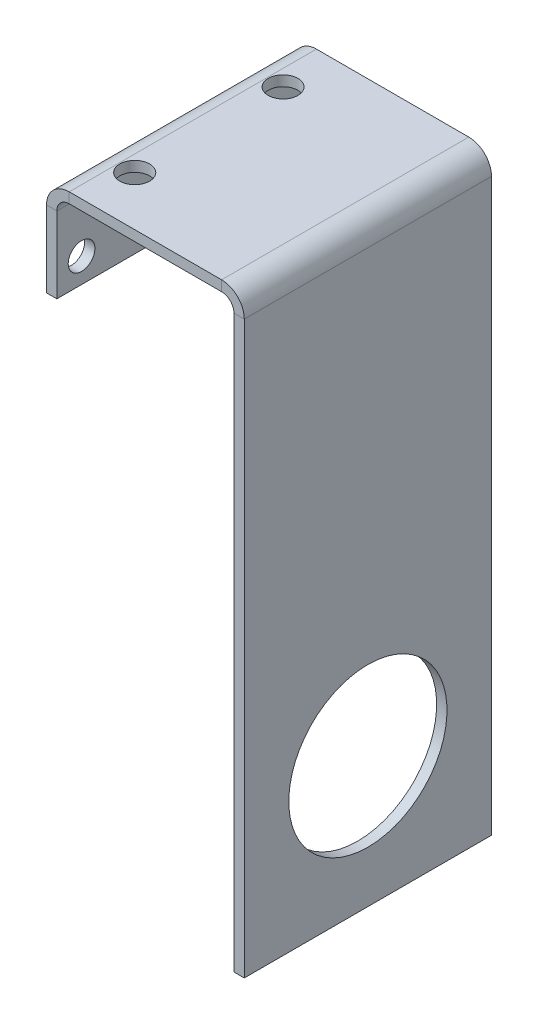
ISO-10303-21;
HEADER;
FILE_DESCRIPTION(('STEP AP214'),'2;1');
FILE_NAME('part.step','',(''),(''),'','','');
FILE_SCHEMA(('AUTOMOTIVE_DESIGN { 1 0 10303 214 1 1 1 1 }'));
ENDSEC;
DATA;
#1=APPLICATION_CONTEXT('core data for automotive mechanical design processes');
#2=APPLICATION_PROTOCOL_DEFINITION('international standard','automotive_design',2000,#1);
#3=PRODUCT_CONTEXT('',#1,'mechanical');
#4=PRODUCT('Part','Part','',(#3));
#5=PRODUCT_RELATED_PRODUCT_CATEGORY('part','',(#4));
#6=PRODUCT_DEFINITION_FORMATION('','',#4);
#7=PRODUCT_DEFINITION_CONTEXT('part definition',#1,'design');
#8=PRODUCT_DEFINITION('design','',#6,#7);
#9=PRODUCT_DEFINITION_SHAPE('','',#8);
#10=(LENGTH_UNIT() NAMED_UNIT(*) SI_UNIT(.MILLI.,.METRE.));
#11=(NAMED_UNIT(*) PLANE_ANGLE_UNIT() SI_UNIT($,.RADIAN.));
#12=(NAMED_UNIT(*) SI_UNIT($,.STERADIAN.) SOLID_ANGLE_UNIT());
#13=UNCERTAINTY_MEASURE_WITH_UNIT(LENGTH_MEASURE(1.E-05),#10,'distance_accuracy_value','');
#14=(GEOMETRIC_REPRESENTATION_CONTEXT(3) GLOBAL_UNCERTAINTY_ASSIGNED_CONTEXT((#13)) GLOBAL_UNIT_ASSIGNED_CONTEXT((#10,
#11,#12)) REPRESENTATION_CONTEXT('',''));
#15=CARTESIAN_POINT('',(0.,0.,0.));
#16=DIRECTION('',(0.,0.,1.));
#17=DIRECTION('',(1.,0.,0.));
#18=AXIS2_PLACEMENT_3D('',#15,#16,#17);
#19=CARTESIAN_POINT('',(5.83184,25.4,63.5));
#20=DIRECTION('',(0.,0.,1.));
#21=DIRECTION('',(1.,0.,0.));
#22=AXIS2_PLACEMENT_3D('',#19,#20,#21);
#23=PLANE('',#22);
#24=DIRECTION('',(0.,-1.,0.));
#25=VECTOR('',#24,1.);
#26=CARTESIAN_POINT('',(5.83184,25.4,63.5));
#27=LINE('',#26,#25);
#28=CARTESIAN_POINT('',(5.83184,25.4,63.5));
#29=VERTEX_POINT('',#28);
#30=CARTESIAN_POINT('',(5.83184,22.74316,63.5));
#31=VERTEX_POINT('',#30);
#32=EDGE_CURVE('E11',#29,#31,#27,.T.);
#33=ORIENTED_EDGE('',*,*,#32,.F.);
#34=CARTESIAN_POINT('',(5.83184,19.56816,63.5));
#35=DIRECTION('',(0.,0.,1.));
#36=DIRECTION('',(1.,0.,0.));
#37=AXIS2_PLACEMENT_3D('',#34,#35,#36);
#38=CIRCLE('',#37,5.83184);
#39=CARTESIAN_POINT('',(0.,19.56816,63.5));
#40=VERTEX_POINT('',#39);
#41=EDGE_CURVE('E283',#40,#29,#38,.F.);
#42=ORIENTED_EDGE('',*,*,#41,.F.);
#43=DIRECTION('',(-1.,0.,0.));
#44=VECTOR('',#43,1.);
#45=CARTESIAN_POINT('',(2.65684,19.56816,63.5));
#46=LINE('',#45,#44);
#47=CARTESIAN_POINT('',(2.65684,19.56816,63.5));
#48=VERTEX_POINT('',#47);
#49=EDGE_CURVE('E49',#48,#40,#46,.T.);
#50=ORIENTED_EDGE('',*,*,#49,.F.);
#51=CARTESIAN_POINT('',(5.83184,19.56816,63.5));
#52=DIRECTION('',(0.,0.,1.));
#53=DIRECTION('',(1.,0.,0.));
#54=AXIS2_PLACEMENT_3D('',#51,#52,#53);
#55=CIRCLE('',#54,3.175);
#56=EDGE_CURVE('E151',#48,#31,#55,.F.);
#57=ORIENTED_EDGE('',*,*,#56,.T.);
#58=EDGE_LOOP('',(#33,#42,#50,#57));
#59=FACE_BOUND('',#58,.T.);
#60=ADVANCED_FACE('F40',(#59),#23,.T.);
#61=CARTESIAN_POINT('',(2.65684,19.56816,63.5));
#62=DIRECTION('',(0.,0.,1.));
#63=DIRECTION('',(1.,0.,0.));
#64=AXIS2_PLACEMENT_3D('',#61,#62,#63);
#65=PLANE('',#64);
#66=DIRECTION('',(1.,0.,0.));
#67=VECTOR('',#66,1.);
#68=CARTESIAN_POINT('',(0.,25.4,63.5));
#69=LINE('',#68,#67);
#70=CARTESIAN_POINT('',(44.96816,25.4,63.5));
#71=VERTEX_POINT('',#70);
#72=EDGE_CURVE('E145',#29,#71,#69,.T.);
#73=ORIENTED_EDGE('',*,*,#72,.F.);
#74=ORIENTED_EDGE('',*,*,#32,.T.);
#75=DIRECTION('',(1.,0.,0.));
#76=VECTOR('',#75,1.);
#77=CARTESIAN_POINT('',(0.,22.74316,63.5));
#78=LINE('',#77,#76);
#79=CARTESIAN_POINT('',(44.96816,22.74316,63.5));
#80=VERTEX_POINT('',#79);
#81=EDGE_CURVE('E142',#31,#80,#78,.T.);
#82=ORIENTED_EDGE('',*,*,#81,.T.);
#83=DIRECTION('',(0.,1.,0.));
#84=VECTOR('',#83,1.);
#85=CARTESIAN_POINT('',(44.96816,22.74316,63.5));
#86=LINE('',#85,#84);
#87=EDGE_CURVE('E234',#80,#71,#86,.T.);
#88=ORIENTED_EDGE('',*,*,#87,.T.);
#89=EDGE_LOOP('',(#73,#74,#82,#88));
#90=FACE_BOUND('',#89,.T.);
#91=ADVANCED_FACE('F140',(#90),#65,.T.);
#92=CARTESIAN_POINT('',(0.,19.56816,0.));
#93=DIRECTION('',(0.,0.,-1.));
#94=DIRECTION('',(-1.,0.,0.));
#95=AXIS2_PLACEMENT_3D('',#92,#93,#94);
#96=PLANE('',#95);
#97=DIRECTION('',(1.,0.,0.));
#98=VECTOR('',#97,1.);
#99=CARTESIAN_POINT('',(0.,19.56816,0.));
#100=LINE('',#99,#98);
#101=CARTESIAN_POINT('',(0.,19.56816,0.));
#102=VERTEX_POINT('',#101);
#103=CARTESIAN_POINT('',(2.65684,19.56816,0.));
#104=VERTEX_POINT('',#103);
#105=EDGE_CURVE('E239',#102,#104,#100,.T.);
#106=ORIENTED_EDGE('',*,*,#105,.F.);
#107=CARTESIAN_POINT('',(5.83184,19.56816,0.));
#108=DIRECTION('',(0.,0.,1.));
#109=DIRECTION('',(1.,0.,0.));
#110=AXIS2_PLACEMENT_3D('',#107,#108,#109);
#111=CIRCLE('',#110,5.83184);
#112=CARTESIAN_POINT('',(5.83184,25.4,0.));
#113=VERTEX_POINT('',#112);
#114=EDGE_CURVE('E191',#102,#113,#111,.F.);
#115=ORIENTED_EDGE('',*,*,#114,.T.);
#116=DIRECTION('',(0.,1.,0.));
#117=VECTOR('',#116,1.);
#118=CARTESIAN_POINT('',(5.83184,22.74316,0.));
#119=LINE('',#118,#117);
#120=CARTESIAN_POINT('',(5.83184,22.74316,0.));
#121=VERTEX_POINT('',#120);
#122=EDGE_CURVE('E237',#121,#113,#119,.T.);
#123=ORIENTED_EDGE('',*,*,#122,.F.);
#124=CARTESIAN_POINT('',(5.83184,19.56816,0.));
#125=DIRECTION('',(0.,0.,1.));
#126=DIRECTION('',(1.,0.,0.));
#127=AXIS2_PLACEMENT_3D('',#124,#125,#126);
#128=CIRCLE('',#127,3.175);
#129=EDGE_CURVE('E163',#104,#121,#128,.F.);
#130=ORIENTED_EDGE('',*,*,#129,.F.);
#131=EDGE_LOOP('',(#106,#115,#123,#130));
#132=FACE_BOUND('',#131,.T.);
#133=ADVANCED_FACE('F301',(#132),#96,.T.);
#134=CARTESIAN_POINT('',(5.83184,22.74316,0.));
#135=DIRECTION('',(0.,0.,-1.));
#136=DIRECTION('',(-1.,0.,0.));
#137=AXIS2_PLACEMENT_3D('',#134,#135,#136);
#138=PLANE('',#137);
#139=DIRECTION('',(0.,1.,0.));
#140=VECTOR('',#139,1.);
#141=CARTESIAN_POINT('',(0.,0.,0.));
#142=LINE('',#141,#140);
#143=CARTESIAN_POINT('',(0.,0.,0.));
#144=VERTEX_POINT('',#143);
#145=EDGE_CURVE('E194',#144,#102,#142,.T.);
#146=ORIENTED_EDGE('',*,*,#145,.T.);
#147=ORIENTED_EDGE('',*,*,#105,.T.);
#148=DIRECTION('',(0.,1.,0.));
#149=VECTOR('',#148,1.);
#150=CARTESIAN_POINT('',(2.65684,0.,0.));
#151=LINE('',#150,#149);
#152=CARTESIAN_POINT('',(2.65684,0.,0.));
#153=VERTEX_POINT('',#152);
#154=EDGE_CURVE('E200',#153,#104,#151,.T.);
#155=ORIENTED_EDGE('',*,*,#154,.F.);
#156=DIRECTION('',(-1.,0.,0.));
#157=VECTOR('',#156,1.);
#158=CARTESIAN_POINT('',(2.65684,0.,0.));
#159=LINE('',#158,#157);
#160=EDGE_CURVE('E197',#153,#144,#159,.T.);
#161=ORIENTED_EDGE('',*,*,#160,.T.);
#162=EDGE_LOOP('',(#146,#147,#155,#161));
#163=FACE_BOUND('',#162,.T.);
#164=ADVANCED_FACE('F348',(#163),#138,.T.);
#165=CARTESIAN_POINT('',(50.8,19.56816,63.5));
#166=DIRECTION('',(0.,0.,1.));
#167=DIRECTION('',(1.,0.,0.));
#168=AXIS2_PLACEMENT_3D('',#165,#166,#167);
#169=PLANE('',#168);
#170=DIRECTION('',(-1.,0.,0.));
#171=VECTOR('',#170,1.);
#172=CARTESIAN_POINT('',(50.8,19.56816,63.5));
#173=LINE('',#172,#171);
#174=CARTESIAN_POINT('',(50.8,19.56816,63.5));
#175=VERTEX_POINT('',#174);
#176=CARTESIAN_POINT('',(48.14316,19.56816,63.5));
#177=VERTEX_POINT('',#176);
#178=EDGE_CURVE('E58',#175,#177,#173,.T.);
#179=ORIENTED_EDGE('',*,*,#178,.F.);
#180=CARTESIAN_POINT('',(44.96816,19.56816,63.5));
#181=DIRECTION('',(0.,0.,1.));
#182=DIRECTION('',(1.,0.,0.));
#183=AXIS2_PLACEMENT_3D('',#180,#181,#182);
#184=CIRCLE('',#183,5.83184);
#185=EDGE_CURVE('E279',#71,#175,#184,.F.);
#186=ORIENTED_EDGE('',*,*,#185,.F.);
#187=ORIENTED_EDGE('',*,*,#87,.F.);
#188=CARTESIAN_POINT('',(44.96816,19.56816,63.5));
#189=DIRECTION('',(0.,0.,1.));
#190=DIRECTION('',(1.,0.,0.));
#191=AXIS2_PLACEMENT_3D('',#188,#189,#190);
#192=CIRCLE('',#191,3.175);
#193=EDGE_CURVE('E171',#80,#177,#192,.F.);
#194=ORIENTED_EDGE('',*,*,#193,.T.);
#195=EDGE_LOOP('',(#179,#186,#187,#194));
#196=FACE_BOUND('',#195,.T.);
#197=ADVANCED_FACE('F353',(#196),#169,.T.);
#198=CARTESIAN_POINT('',(44.96816,22.74316,63.5));
#199=DIRECTION('',(0.,0.,1.));
#200=DIRECTION('',(1.,0.,0.));
#201=AXIS2_PLACEMENT_3D('',#198,#199,#200);
#202=PLANE('',#201);
#203=DIRECTION('',(0.,-1.,0.));
#204=VECTOR('',#203,1.);
#205=CARTESIAN_POINT('',(50.8,25.4,63.5));
#206=LINE('',#205,#204);
#207=CARTESIAN_POINT('',(50.8,-127.,63.5));
#208=VERTEX_POINT('',#207);
#209=EDGE_CURVE('E276',#175,#208,#206,.T.);
#210=ORIENTED_EDGE('',*,*,#209,.F.);
#211=ORIENTED_EDGE('',*,*,#178,.T.);
#212=DIRECTION('',(0.,-1.,0.));
#213=VECTOR('',#212,1.);
#214=CARTESIAN_POINT('',(48.14316,25.4,63.5));
#215=LINE('',#214,#213);
#216=CARTESIAN_POINT('',(48.14316,-127.,63.5));
#217=VERTEX_POINT('',#216);
#218=EDGE_CURVE('E112',#177,#217,#215,.T.);
#219=ORIENTED_EDGE('',*,*,#218,.T.);
#220=DIRECTION('',(-1.,0.,0.));
#221=VECTOR('',#220,1.);
#222=CARTESIAN_POINT('',(50.8,-127.,63.5));
#223=LINE('',#222,#221);
#224=EDGE_CURVE('E273',#208,#217,#223,.T.);
#225=ORIENTED_EDGE('',*,*,#224,.F.);
#226=EDGE_LOOP('',(#210,#211,#219,#225));
#227=FACE_BOUND('',#226,.T.);
#228=ADVANCED_FACE('F328',(#227),#202,.T.);
#229=CARTESIAN_POINT('',(44.96816,25.4,0.));
#230=DIRECTION('',(0.,0.,-1.));
#231=DIRECTION('',(-1.,0.,0.));
#232=AXIS2_PLACEMENT_3D('',#229,#230,#231);
#233=PLANE('',#232);
#234=DIRECTION('',(0.,-1.,0.));
#235=VECTOR('',#234,1.);
#236=CARTESIAN_POINT('',(44.96816,25.4,0.));
#237=LINE('',#236,#235);
#238=CARTESIAN_POINT('',(44.96816,25.4,0.));
#239=VERTEX_POINT('',#238);
#240=CARTESIAN_POINT('',(44.96816,22.74316,0.));
#241=VERTEX_POINT('',#240);
#242=EDGE_CURVE('E99',#239,#241,#237,.T.);
#243=ORIENTED_EDGE('',*,*,#242,.F.);
#244=CARTESIAN_POINT('',(44.96816,19.56816,0.));
#245=DIRECTION('',(0.,0.,1.));
#246=DIRECTION('',(1.,0.,0.));
#247=AXIS2_PLACEMENT_3D('',#244,#245,#246);
#248=CIRCLE('',#247,5.83184);
#249=CARTESIAN_POINT('',(50.8,19.56816,0.));
#250=VERTEX_POINT('',#249);
#251=EDGE_CURVE('E187',#239,#250,#248,.F.);
#252=ORIENTED_EDGE('',*,*,#251,.T.);
#253=DIRECTION('',(1.,0.,0.));
#254=VECTOR('',#253,1.);
#255=CARTESIAN_POINT('',(48.14316,19.56816,0.));
#256=LINE('',#255,#254);
#257=CARTESIAN_POINT('',(48.14316,19.56816,0.));
#258=VERTEX_POINT('',#257);
#259=EDGE_CURVE('E106',#258,#250,#256,.T.);
#260=ORIENTED_EDGE('',*,*,#259,.F.);
#261=CARTESIAN_POINT('',(44.96816,19.56816,0.));
#262=DIRECTION('',(0.,0.,1.));
#263=DIRECTION('',(1.,0.,0.));
#264=AXIS2_PLACEMENT_3D('',#261,#262,#263);
#265=CIRCLE('',#264,3.175);
#266=EDGE_CURVE('E206',#241,#258,#265,.F.);
#267=ORIENTED_EDGE('',*,*,#266,.F.);
#268=EDGE_LOOP('',(#243,#252,#260,#267));
#269=FACE_BOUND('',#268,.T.);
#270=ADVANCED_FACE('F316',(#269),#233,.T.);
#271=CARTESIAN_POINT('',(48.14316,19.56816,0.));
#272=DIRECTION('',(0.,0.,-1.));
#273=DIRECTION('',(-1.,0.,0.));
#274=AXIS2_PLACEMENT_3D('',#271,#272,#273);
#275=PLANE('',#274);
#276=DIRECTION('',(1.,0.,0.));
#277=VECTOR('',#276,1.);
#278=CARTESIAN_POINT('',(0.,25.4,0.));
#279=LINE('',#278,#277);
#280=EDGE_CURVE('E189',#113,#239,#279,.T.);
#281=ORIENTED_EDGE('',*,*,#280,.T.);
#282=ORIENTED_EDGE('',*,*,#242,.T.);
#283=DIRECTION('',(1.,0.,0.));
#284=VECTOR('',#283,1.);
#285=CARTESIAN_POINT('',(0.,22.74316,0.));
#286=LINE('',#285,#284);
#287=EDGE_CURVE('E204',#121,#241,#286,.T.);
#288=ORIENTED_EDGE('',*,*,#287,.F.);
#289=ORIENTED_EDGE('',*,*,#122,.T.);
#290=EDGE_LOOP('',(#281,#282,#288,#289));
#291=FACE_BOUND('',#290,.T.);
#292=ADVANCED_FACE('F303',(#291),#275,.T.);
#293=CARTESIAN_POINT('',(48.14316,25.4,63.5));
#294=DIRECTION('',(1.,0.,0.));
#295=DIRECTION('',(0.,1.,0.));
#296=AXIS2_PLACEMENT_3D('',#293,#294,#295);
#297=PLANE('',#296);
#298=CARTESIAN_POINT('',(48.14316,-93.46184,31.75));
#299=DIRECTION('',(1.,0.,0.));
#300=DIRECTION('',(0.,1.,0.));
#301=AXIS2_PLACEMENT_3D('',#298,#299,#300);
#302=CIRCLE('',#301,20.32);
#303=CARTESIAN_POINT('',(48.14316,-73.14184,31.75));
#304=VERTEX_POINT('',#303);
#305=EDGE_CURVE('E264',#304,#304,#302,.T.);
#306=ORIENTED_EDGE('',*,*,#305,.T.);
#307=EDGE_LOOP('',(#306));
#308=FACE_BOUND('',#307,.T.);
#309=DIRECTION('',(0.,-1.,0.));
#310=VECTOR('',#309,1.);
#311=CARTESIAN_POINT('',(48.14316,25.4,0.));
#312=LINE('',#311,#310);
#313=CARTESIAN_POINT('',(48.14316,-127.,0.));
#314=VERTEX_POINT('',#313);
#315=EDGE_CURVE('E177',#258,#314,#312,.T.);
#316=ORIENTED_EDGE('',*,*,#315,.T.);
#317=DIRECTION('',(0.,0.,-1.));
#318=VECTOR('',#317,1.);
#319=CARTESIAN_POINT('',(48.14316,-127.,63.5));
#320=LINE('',#319,#318);
#321=EDGE_CURVE('E230',#217,#314,#320,.T.);
#322=ORIENTED_EDGE('',*,*,#321,.F.);
#323=ORIENTED_EDGE('',*,*,#218,.F.);
#324=DIRECTION('',(0.,0.,-1.));
#325=VECTOR('',#324,1.);
#326=CARTESIAN_POINT('',(48.14316,19.56816,63.5));
#327=LINE('',#326,#325);
#328=EDGE_CURVE('E173',#177,#258,#327,.T.);
#329=ORIENTED_EDGE('',*,*,#328,.T.);
#330=EDGE_LOOP('',(#316,#322,#323,#329));
#331=FACE_BOUND('',#330,.T.);
#332=ADVANCED_FACE('F322',(#308,#331),#297,.F.);
#333=CARTESIAN_POINT('',(50.8,-127.,63.5));
#334=DIRECTION('',(0.,-1.,0.));
#335=DIRECTION('',(0.,0.,-1.));
#336=AXIS2_PLACEMENT_3D('',#333,#334,#335);
#337=PLANE('',#336);
#338=DIRECTION('',(-1.,0.,0.));
#339=VECTOR('',#338,1.);
#340=CARTESIAN_POINT('',(50.8,-127.,0.));
#341=LINE('',#340,#339);
#342=CARTESIAN_POINT('',(50.8,-127.,0.));
#343=VERTEX_POINT('',#342);
#344=EDGE_CURVE('E180',#343,#314,#341,.T.);
#345=ORIENTED_EDGE('',*,*,#344,.F.);
#346=DIRECTION('',(0.,0.,-1.));
#347=VECTOR('',#346,1.);
#348=CARTESIAN_POINT('',(50.8,-127.,63.5));
#349=LINE('',#348,#347);
#350=EDGE_CURVE('E228',#208,#343,#349,.T.);
#351=ORIENTED_EDGE('',*,*,#350,.F.);
#352=ORIENTED_EDGE('',*,*,#224,.T.);
#353=ORIENTED_EDGE('',*,*,#321,.T.);
#354=EDGE_LOOP('',(#345,#351,#352,#353));
#355=FACE_BOUND('',#354,.T.);
#356=ADVANCED_FACE('F327',(#355),#337,.T.);
#357=CARTESIAN_POINT('',(50.8,25.4,63.5));
#358=DIRECTION('',(1.,0.,0.));
#359=DIRECTION('',(0.,1.,0.));
#360=AXIS2_PLACEMENT_3D('',#357,#358,#359);
#361=PLANE('',#360);
#362=CARTESIAN_POINT('',(50.8,-93.46184,31.75));
#363=DIRECTION('',(1.,0.,0.));
#364=DIRECTION('',(0.,1.,0.));
#365=AXIS2_PLACEMENT_3D('',#362,#363,#364);
#366=CIRCLE('',#365,20.32);
#367=CARTESIAN_POINT('',(50.8,-73.14184,31.75));
#368=VERTEX_POINT('',#367);
#369=EDGE_CURVE('E253',#368,#368,#366,.T.);
#370=ORIENTED_EDGE('',*,*,#369,.F.);
#371=EDGE_LOOP('',(#370));
#372=FACE_BOUND('',#371,.T.);
#373=DIRECTION('',(0.,-1.,0.));
#374=VECTOR('',#373,1.);
#375=CARTESIAN_POINT('',(50.8,25.4,0.));
#376=LINE('',#375,#374);
#377=EDGE_CURVE('E184',#250,#343,#376,.T.);
#378=ORIENTED_EDGE('',*,*,#377,.F.);
#379=DIRECTION('',(0.,0.,-1.));
#380=VECTOR('',#379,1.);
#381=CARTESIAN_POINT('',(50.8,19.56816,63.5));
#382=LINE('',#381,#380);
#383=EDGE_CURVE('E225',#175,#250,#382,.T.);
#384=ORIENTED_EDGE('',*,*,#383,.F.);
#385=ORIENTED_EDGE('',*,*,#209,.T.);
#386=ORIENTED_EDGE('',*,*,#350,.T.);
#387=EDGE_LOOP('',(#378,#384,#385,#386));
#388=FACE_BOUND('',#387,.T.);
#389=ADVANCED_FACE('F330',(#372,#388),#361,.T.);
#390=CARTESIAN_POINT('',(44.96816,19.56816,63.5));
#391=DIRECTION('',(0.,0.,-1.));
#392=DIRECTION('',(-1.,0.,0.));
#393=AXIS2_PLACEMENT_3D('',#390,#391,#392);
#394=CYLINDRICAL_SURFACE('',#393,5.83184);
#395=ORIENTED_EDGE('',*,*,#251,.F.);
#396=DIRECTION('',(0.,0.,-1.));
#397=VECTOR('',#396,1.);
#398=CARTESIAN_POINT('',(44.96816,25.4,63.5));
#399=LINE('',#398,#397);
#400=EDGE_CURVE('E222',#71,#239,#399,.T.);
#401=ORIENTED_EDGE('',*,*,#400,.F.);
#402=ORIENTED_EDGE('',*,*,#185,.T.);
#403=ORIENTED_EDGE('',*,*,#383,.T.);
#404=EDGE_LOOP('',(#395,#401,#402,#403));
#405=FACE_BOUND('',#404,.T.);
#406=ADVANCED_FACE('F313',(#405),#394,.T.);
#407=CARTESIAN_POINT('',(0.,25.4,63.5));
#408=DIRECTION('',(0.,1.,0.));
#409=DIRECTION('',(0.,0.,1.));
#410=AXIS2_PLACEMENT_3D('',#407,#408,#409);
#411=PLANE('',#410);
#412=CARTESIAN_POINT('',(9.95680000035909,25.4,12.6999999983096));
#413=DIRECTION('',(0.,1.,0.));
#414=DIRECTION('',(0.,0.,1.));
#415=AXIS2_PLACEMENT_3D('',#412,#413,#414);
#416=CIRCLE('',#415,3.809999999705);
#417=CARTESIAN_POINT('',(9.95680000035909,25.4,16.5099999980146));
#418=VERTEX_POINT('',#417);
#419=EDGE_CURVE('E249',#418,#418,#416,.T.);
#420=ORIENTED_EDGE('',*,*,#419,.F.);
#421=EDGE_LOOP('',(#420));
#422=FACE_BOUND('',#421,.T.);
#423=CARTESIAN_POINT('',(9.95680000035942,25.4,50.7999999983095));
#424=DIRECTION('',(0.,1.,0.));
#425=DIRECTION('',(0.,0.,1.));
#426=AXIS2_PLACEMENT_3D('',#423,#424,#425);
#427=CIRCLE('',#426,3.83152444364482);
#428=CARTESIAN_POINT('',(9.95680000035942,25.4,54.6315244419543));
#429=VERTEX_POINT('',#428);
#430=EDGE_CURVE('E255',#429,#429,#427,.T.);
#431=ORIENTED_EDGE('',*,*,#430,.F.);
#432=EDGE_LOOP('',(#431));
#433=FACE_BOUND('',#432,.T.);
#434=ORIENTED_EDGE('',*,*,#280,.F.);
#435=DIRECTION('',(0.,0.,-1.));
#436=VECTOR('',#435,1.);
#437=CARTESIAN_POINT('',(5.83184,25.4,63.5));
#438=LINE('',#437,#436);
#439=EDGE_CURVE('E219',#29,#113,#438,.T.);
#440=ORIENTED_EDGE('',*,*,#439,.F.);
#441=ORIENTED_EDGE('',*,*,#72,.T.);
#442=ORIENTED_EDGE('',*,*,#400,.T.);
#443=EDGE_LOOP('',(#434,#440,#441,#442));
#444=FACE_BOUND('',#443,.T.);
#445=ADVANCED_FACE('F308',(#422,#433,#444),#411,.T.);
#446=CARTESIAN_POINT('',(5.83184,19.56816,63.5));
#447=DIRECTION('',(0.,0.,-1.));
#448=DIRECTION('',(-1.,0.,0.));
#449=AXIS2_PLACEMENT_3D('',#446,#447,#448);
#450=CYLINDRICAL_SURFACE('',#449,5.83184);
#451=ORIENTED_EDGE('',*,*,#114,.F.);
#452=DIRECTION('',(0.,0.,-1.));
#453=VECTOR('',#452,1.);
#454=CARTESIAN_POINT('',(0.,19.56816,63.5));
#455=LINE('',#454,#453);
#456=EDGE_CURVE('E216',#40,#102,#455,.T.);
#457=ORIENTED_EDGE('',*,*,#456,.F.);
#458=ORIENTED_EDGE('',*,*,#41,.T.);
#459=ORIENTED_EDGE('',*,*,#439,.T.);
#460=EDGE_LOOP('',(#451,#457,#458,#459));
#461=FACE_BOUND('',#460,.T.);
#462=ADVANCED_FACE('F306',(#461),#450,.T.);
#463=CARTESIAN_POINT('',(0.,0.,63.5));
#464=DIRECTION('',(-1.,0.,0.));
#465=DIRECTION('',(0.,0.,1.));
#466=AXIS2_PLACEMENT_3D('',#463,#464,#465);
#467=PLANE('',#466);
#468=CARTESIAN_POINT('',(0.,6.35,6.35));
#469=DIRECTION('',(-1.,0.,0.));
#470=DIRECTION('',(0.,0.,1.));
#471=AXIS2_PLACEMENT_3D('',#468,#469,#470);
#472=CIRCLE('',#471,3.429);
#473=CARTESIAN_POINT('',(0.,6.35,9.779));
#474=VERTEX_POINT('',#473);
#475=EDGE_CURVE('E245',#474,#474,#472,.T.);
#476=ORIENTED_EDGE('',*,*,#475,.F.);
#477=EDGE_LOOP('',(#476));
#478=FACE_BOUND('',#477,.T.);
#479=CARTESIAN_POINT('',(0.,6.35,57.15));
#480=DIRECTION('',(-1.,0.,0.));
#481=DIRECTION('',(0.,0.,1.));
#482=AXIS2_PLACEMENT_3D('',#479,#480,#481);
#483=CIRCLE('',#482,3.429);
#484=CARTESIAN_POINT('',(0.,6.35,60.579));
#485=VERTEX_POINT('',#484);
#486=EDGE_CURVE('E267',#485,#485,#483,.T.);
#487=ORIENTED_EDGE('',*,*,#486,.F.);
#488=EDGE_LOOP('',(#487));
#489=FACE_BOUND('',#488,.T.);
#490=ORIENTED_EDGE('',*,*,#145,.F.);
#491=DIRECTION('',(0.,0.,-1.));
#492=VECTOR('',#491,1.);
#493=CARTESIAN_POINT('',(0.,0.,63.5));
#494=LINE('',#493,#492);
#495=CARTESIAN_POINT('',(0.,0.,63.5));
#496=VERTEX_POINT('',#495);
#497=EDGE_CURVE('E214',#496,#144,#494,.T.);
#498=ORIENTED_EDGE('',*,*,#497,.F.);
#499=DIRECTION('',(0.,1.,0.));
#500=VECTOR('',#499,1.);
#501=CARTESIAN_POINT('',(0.,0.,63.5));
#502=LINE('',#501,#500);
#503=EDGE_CURVE('E285',#496,#40,#502,.T.);
#504=ORIENTED_EDGE('',*,*,#503,.T.);
#505=ORIENTED_EDGE('',*,*,#456,.T.);
#506=EDGE_LOOP('',(#490,#498,#504,#505));
#507=FACE_BOUND('',#506,.T.);
#508=ADVANCED_FACE('F408',(#478,#489,#507),#467,.T.);
#509=CARTESIAN_POINT('',(2.65684,0.,63.5));
#510=DIRECTION('',(0.,-1.,0.));
#511=DIRECTION('',(0.,0.,-1.));
#512=AXIS2_PLACEMENT_3D('',#509,#510,#511);
#513=PLANE('',#512);
#514=ORIENTED_EDGE('',*,*,#160,.F.);
#515=DIRECTION('',(0.,0.,-1.));
#516=VECTOR('',#515,1.);
#517=CARTESIAN_POINT('',(2.65684,0.,63.5));
#518=LINE('',#517,#516);
#519=CARTESIAN_POINT('',(2.65684,0.,63.5));
#520=VERTEX_POINT('',#519);
#521=EDGE_CURVE('E212',#520,#153,#518,.T.);
#522=ORIENTED_EDGE('',*,*,#521,.F.);
#523=DIRECTION('',(-1.,0.,0.));
#524=VECTOR('',#523,1.);
#525=CARTESIAN_POINT('',(2.65684,0.,63.5));
#526=LINE('',#525,#524);
#527=EDGE_CURVE('E288',#520,#496,#526,.T.);
#528=ORIENTED_EDGE('',*,*,#527,.T.);
#529=ORIENTED_EDGE('',*,*,#497,.T.);
#530=EDGE_LOOP('',(#514,#522,#528,#529));
#531=FACE_BOUND('',#530,.T.);
#532=ADVANCED_FACE('F404',(#531),#513,.T.);
#533=CARTESIAN_POINT('',(2.65684,0.,63.5));
#534=DIRECTION('',(-1.,0.,0.));
#535=DIRECTION('',(0.,0.,1.));
#536=AXIS2_PLACEMENT_3D('',#533,#534,#535);
#537=PLANE('',#536);
#538=CARTESIAN_POINT('',(2.65684,6.35,6.35));
#539=DIRECTION('',(-1.,0.,0.));
#540=DIRECTION('',(0.,0.,1.));
#541=AXIS2_PLACEMENT_3D('',#538,#539,#540);
#542=CIRCLE('',#541,3.429);
#543=CARTESIAN_POINT('',(2.65684,6.35,9.779));
#544=VERTEX_POINT('',#543);
#545=EDGE_CURVE('E181',#544,#544,#542,.T.);
#546=ORIENTED_EDGE('',*,*,#545,.T.);
#547=EDGE_LOOP('',(#546));
#548=FACE_BOUND('',#547,.T.);
#549=CARTESIAN_POINT('',(2.65684,6.35,57.15));
#550=DIRECTION('',(-1.,0.,0.));
#551=DIRECTION('',(0.,0.,1.));
#552=AXIS2_PLACEMENT_3D('',#549,#550,#551);
#553=CIRCLE('',#552,3.429);
#554=CARTESIAN_POINT('',(2.65684,6.35,60.579));
#555=VERTEX_POINT('',#554);
#556=EDGE_CURVE('E242',#555,#555,#553,.T.);
#557=ORIENTED_EDGE('',*,*,#556,.T.);
#558=EDGE_LOOP('',(#557));
#559=FACE_BOUND('',#558,.T.);
#560=ORIENTED_EDGE('',*,*,#154,.T.);
#561=DIRECTION('',(0.,0.,-1.));
#562=VECTOR('',#561,1.);
#563=CARTESIAN_POINT('',(2.65684,19.56816,63.5));
#564=LINE('',#563,#562);
#565=EDGE_CURVE('E165',#48,#104,#564,.T.);
#566=ORIENTED_EDGE('',*,*,#565,.F.);
#567=DIRECTION('',(0.,1.,0.));
#568=VECTOR('',#567,1.);
#569=CARTESIAN_POINT('',(2.65684,0.,63.5));
#570=LINE('',#569,#568);
#571=EDGE_CURVE('E156',#520,#48,#570,.T.);
#572=ORIENTED_EDGE('',*,*,#571,.F.);
#573=ORIENTED_EDGE('',*,*,#521,.T.);
#574=EDGE_LOOP('',(#560,#566,#572,#573));
#575=FACE_BOUND('',#574,.T.);
#576=ADVANCED_FACE('F298',(#548,#559,#575),#537,.F.);
#577=CARTESIAN_POINT('',(5.83184,19.56816,63.5));
#578=DIRECTION('',(0.,0.,-1.));
#579=DIRECTION('',(-1.,0.,0.));
#580=AXIS2_PLACEMENT_3D('',#577,#578,#579);
#581=CYLINDRICAL_SURFACE('',#580,3.175);
#582=ORIENTED_EDGE('',*,*,#129,.T.);
#583=DIRECTION('',(0.,0.,-1.));
#584=VECTOR('',#583,1.);
#585=CARTESIAN_POINT('',(5.83184,22.74316,63.5));
#586=LINE('',#585,#584);
#587=EDGE_CURVE('E160',#31,#121,#586,.T.);
#588=ORIENTED_EDGE('',*,*,#587,.F.);
#589=ORIENTED_EDGE('',*,*,#56,.F.);
#590=ORIENTED_EDGE('',*,*,#565,.T.);
#591=EDGE_LOOP('',(#582,#588,#589,#590));
#592=FACE_BOUND('',#591,.T.);
#593=ADVANCED_FACE('F161',(#592),#581,.F.);
#594=CARTESIAN_POINT('',(0.,22.74316,63.5));
#595=DIRECTION('',(0.,1.,0.));
#596=DIRECTION('',(0.,0.,1.));
#597=AXIS2_PLACEMENT_3D('',#594,#595,#596);
#598=PLANE('',#597);
#599=CARTESIAN_POINT('',(9.95680000035909,22.74316,12.6999999983096));
#600=DIRECTION('',(0.,1.,0.));
#601=DIRECTION('',(0.,0.,1.));
#602=AXIS2_PLACEMENT_3D('',#599,#600,#601);
#603=CIRCLE('',#602,3.809999999705);
#604=CARTESIAN_POINT('',(9.95680000035909,22.74316,16.5099999980146));
#605=VERTEX_POINT('',#604);
#606=EDGE_CURVE('E43',#605,#605,#603,.T.);
#607=ORIENTED_EDGE('',*,*,#606,.T.);
#608=EDGE_LOOP('',(#607));
#609=FACE_BOUND('',#608,.T.);
#610=CARTESIAN_POINT('',(9.95680000035942,22.74316,50.7999999983095));
#611=DIRECTION('',(0.,1.,0.));
#612=DIRECTION('',(0.,0.,1.));
#613=AXIS2_PLACEMENT_3D('',#610,#611,#612);
#614=CIRCLE('',#613,3.83152444364482);
#615=CARTESIAN_POINT('',(9.95680000035942,22.74316,54.6315244419543));
#616=VERTEX_POINT('',#615);
#617=EDGE_CURVE('E247',#616,#616,#614,.T.);
#618=ORIENTED_EDGE('',*,*,#617,.T.);
#619=EDGE_LOOP('',(#618));
#620=FACE_BOUND('',#619,.T.);
#621=ORIENTED_EDGE('',*,*,#287,.T.);
#622=DIRECTION('',(0.,0.,-1.));
#623=VECTOR('',#622,1.);
#624=CARTESIAN_POINT('',(44.96816,22.74316,63.5));
#625=LINE('',#624,#623);
#626=EDGE_CURVE('E166',#80,#241,#625,.T.);
#627=ORIENTED_EDGE('',*,*,#626,.F.);
#628=ORIENTED_EDGE('',*,*,#81,.F.);
#629=ORIENTED_EDGE('',*,*,#587,.T.);
#630=EDGE_LOOP('',(#621,#627,#628,#629));
#631=FACE_BOUND('',#630,.T.);
#632=ADVANCED_FACE('F168',(#609,#620,#631),#598,.F.);
#633=CARTESIAN_POINT('',(44.96816,19.56816,63.5));
#634=DIRECTION('',(0.,0.,-1.));
#635=DIRECTION('',(-1.,0.,0.));
#636=AXIS2_PLACEMENT_3D('',#633,#634,#635);
#637=CYLINDRICAL_SURFACE('',#636,3.175);
#638=ORIENTED_EDGE('',*,*,#266,.T.);
#639=ORIENTED_EDGE('',*,*,#328,.F.);
#640=ORIENTED_EDGE('',*,*,#193,.F.);
#641=ORIENTED_EDGE('',*,*,#626,.T.);
#642=EDGE_LOOP('',(#638,#639,#640,#641));
#643=FACE_BOUND('',#642,.T.);
#644=ADVANCED_FACE('F319',(#643),#637,.F.);
#645=CARTESIAN_POINT('',(44.96816,19.56816,63.5));
#646=DIRECTION('',(0.,0.,1.));
#647=DIRECTION('',(1.,0.,0.));
#648=AXIS2_PLACEMENT_3D('',#645,#646,#647);
#649=PLANE('',#648);
#650=ORIENTED_EDGE('',*,*,#571,.T.);
#651=ORIENTED_EDGE('',*,*,#49,.T.);
#652=ORIENTED_EDGE('',*,*,#503,.F.);
#653=ORIENTED_EDGE('',*,*,#527,.F.);
#654=EDGE_LOOP('',(#650,#651,#652,#653));
#655=FACE_BOUND('',#654,.T.);
#656=ADVANCED_FACE('F294',(#655),#649,.T.);
#657=CARTESIAN_POINT('',(44.96816,19.56816,0.));
#658=DIRECTION('',(0.,0.,1.));
#659=DIRECTION('',(1.,0.,0.));
#660=AXIS2_PLACEMENT_3D('',#657,#658,#659);
#661=PLANE('',#660);
#662=ORIENTED_EDGE('',*,*,#315,.F.);
#663=ORIENTED_EDGE('',*,*,#259,.T.);
#664=ORIENTED_EDGE('',*,*,#377,.T.);
#665=ORIENTED_EDGE('',*,*,#344,.T.);
#666=EDGE_LOOP('',(#662,#663,#664,#665));
#667=FACE_BOUND('',#666,.T.);
#668=ADVANCED_FACE('F324',(#667),#661,.F.);
#669=CARTESIAN_POINT('',(6.35,6.35,57.15));
#670=DIRECTION('',(-1.,0.,0.));
#671=DIRECTION('',(0.,0.,1.));
#672=AXIS2_PLACEMENT_3D('',#669,#670,#671);
#673=CYLINDRICAL_SURFACE('',#672,3.429);
#674=ORIENTED_EDGE('',*,*,#486,.T.);
#675=EDGE_LOOP('',(#674));
#676=FACE_BOUND('',#675,.T.);
#677=ORIENTED_EDGE('',*,*,#556,.F.);
#678=EDGE_LOOP('',(#677));
#679=FACE_BOUND('',#678,.T.);
#680=ADVANCED_FACE('F383',(#676,#679),#673,.F.);
#681=CARTESIAN_POINT('',(6.35,6.35,6.35));
#682=DIRECTION('',(-1.,0.,0.));
#683=DIRECTION('',(0.,0.,1.));
#684=AXIS2_PLACEMENT_3D('',#681,#682,#683);
#685=CYLINDRICAL_SURFACE('',#684,3.429);
#686=ORIENTED_EDGE('',*,*,#475,.T.);
#687=EDGE_LOOP('',(#686));
#688=FACE_BOUND('',#687,.T.);
#689=ORIENTED_EDGE('',*,*,#545,.F.);
#690=EDGE_LOOP('',(#689));
#691=FACE_BOUND('',#690,.T.);
#692=ADVANCED_FACE('F373',(#688,#691),#685,.F.);
#693=CARTESIAN_POINT('',(44.45,-93.46184,31.75));
#694=DIRECTION('',(1.,0.,0.));
#695=DIRECTION('',(0.,1.,0.));
#696=AXIS2_PLACEMENT_3D('',#693,#694,#695);
#697=CYLINDRICAL_SURFACE('',#696,20.32);
#698=ORIENTED_EDGE('',*,*,#369,.T.);
#699=EDGE_LOOP('',(#698));
#700=FACE_BOUND('',#699,.T.);
#701=ORIENTED_EDGE('',*,*,#305,.F.);
#702=EDGE_LOOP('',(#701));
#703=FACE_BOUND('',#702,.T.);
#704=ADVANCED_FACE('F370',(#700,#703),#697,.F.);
#705=CARTESIAN_POINT('',(9.95680000035942,19.05,50.7999999983095));
#706=DIRECTION('',(0.,1.,0.));
#707=DIRECTION('',(0.,0.,1.));
#708=AXIS2_PLACEMENT_3D('',#705,#706,#707);
#709=CYLINDRICAL_SURFACE('',#708,3.83152444364482);
#710=ORIENTED_EDGE('',*,*,#430,.T.);
#711=EDGE_LOOP('',(#710));
#712=FACE_BOUND('',#711,.T.);
#713=ORIENTED_EDGE('',*,*,#617,.F.);
#714=EDGE_LOOP('',(#713));
#715=FACE_BOUND('',#714,.T.);
#716=ADVANCED_FACE('F372',(#712,#715),#709,.F.);
#717=CARTESIAN_POINT('',(9.95680000035909,19.05,12.6999999983096));
#718=DIRECTION('',(0.,1.,0.));
#719=DIRECTION('',(0.,0.,1.));
#720=AXIS2_PLACEMENT_3D('',#717,#718,#719);
#721=CYLINDRICAL_SURFACE('',#720,3.809999999705);
#722=ORIENTED_EDGE('',*,*,#419,.T.);
#723=EDGE_LOOP('',(#722));
#724=FACE_BOUND('',#723,.T.);
#725=ORIENTED_EDGE('',*,*,#606,.F.);
#726=EDGE_LOOP('',(#725));
#727=FACE_BOUND('',#726,.T.);
#728=ADVANCED_FACE('F380',(#724,#727),#721,.F.);
#729=CLOSED_SHELL('',(#60,#91,#133,#164,#197,#228,#270,#292,#332,#356,#389,#406,#445,#462,#508,
#532,#576,#593,#632,#644,#656,#668,#680,#692,#704,#716,#728));
#730=MANIFOLD_SOLID_BREP('B2',#729);
#731=ADVANCED_BREP_SHAPE_REPRESENTATION('',(#18,#730),#14);
#732=SHAPE_DEFINITION_REPRESENTATION(#9,#731);
ENDSEC;
END-ISO-10303-21;
